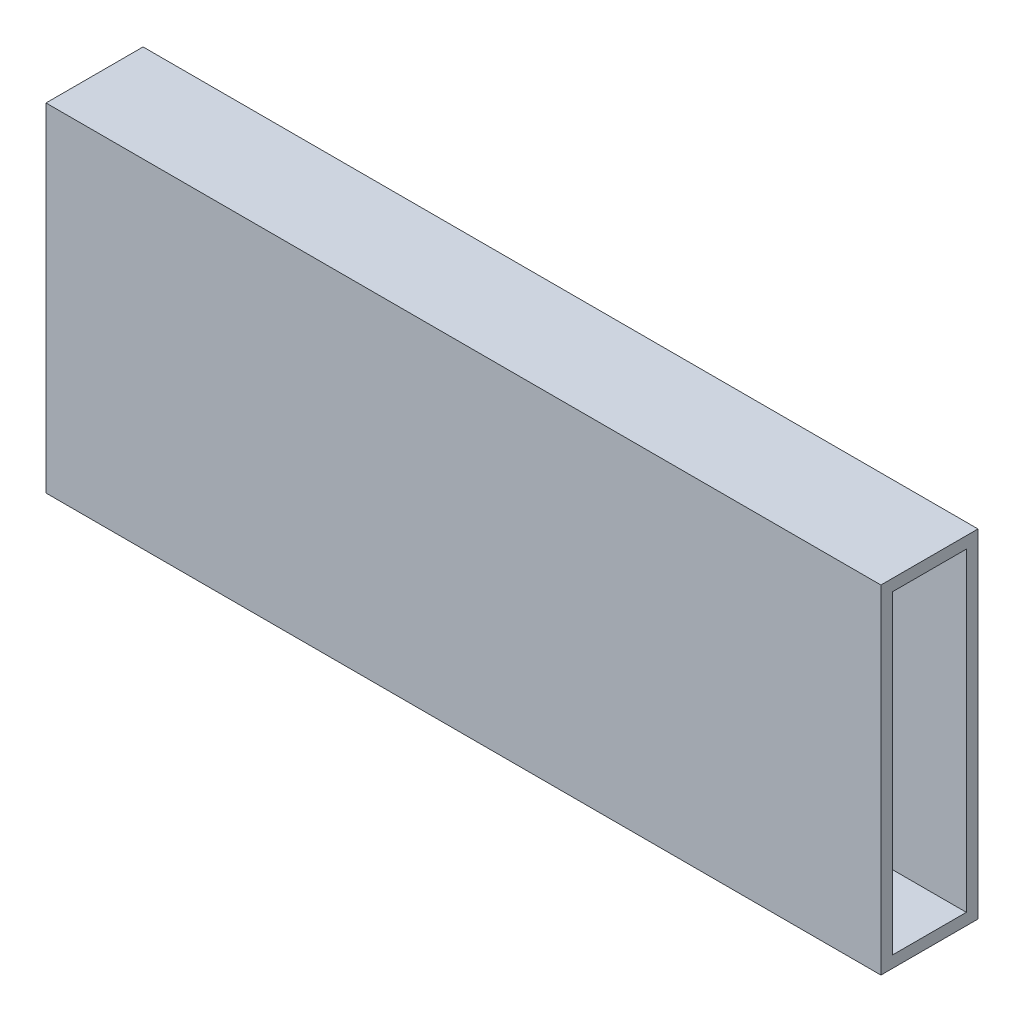
ISO-10303-21;
HEADER;
FILE_DESCRIPTION(('STEP AP214'),'2;1');
FILE_NAME('part.step','',(''),(''),'','','');
FILE_SCHEMA(('AUTOMOTIVE_DESIGN { 1 0 10303 214 1 1 1 1 }'));
ENDSEC;
DATA;
#1=APPLICATION_CONTEXT('core data for automotive mechanical design processes');
#2=APPLICATION_PROTOCOL_DEFINITION('international standard','automotive_design',2000,#1);
#3=PRODUCT_CONTEXT('',#1,'mechanical');
#4=PRODUCT('Part','Part','',(#3));
#5=PRODUCT_RELATED_PRODUCT_CATEGORY('part','',(#4));
#6=PRODUCT_DEFINITION_FORMATION('','',#4);
#7=PRODUCT_DEFINITION_CONTEXT('part definition',#1,'design');
#8=PRODUCT_DEFINITION('design','',#6,#7);
#9=PRODUCT_DEFINITION_SHAPE('','',#8);
#10=(LENGTH_UNIT() NAMED_UNIT(*) SI_UNIT(.MILLI.,.METRE.));
#11=(NAMED_UNIT(*) PLANE_ANGLE_UNIT() SI_UNIT($,.RADIAN.));
#12=(NAMED_UNIT(*) SI_UNIT($,.STERADIAN.) SOLID_ANGLE_UNIT());
#13=UNCERTAINTY_MEASURE_WITH_UNIT(LENGTH_MEASURE(1.E-05),#10,'distance_accuracy_value','');
#14=(GEOMETRIC_REPRESENTATION_CONTEXT(3) GLOBAL_UNCERTAINTY_ASSIGNED_CONTEXT((#13)) GLOBAL_UNIT_ASSIGNED_CONTEXT((#10,
#11,#12)) REPRESENTATION_CONTEXT('',''));
#15=CARTESIAN_POINT('',(0.,0.,0.));
#16=DIRECTION('',(0.,0.,1.));
#17=DIRECTION('',(1.,0.,0.));
#18=AXIS2_PLACEMENT_3D('',#15,#16,#17);
#19=CARTESIAN_POINT('',(107.5,87.,-12.5));
#20=DIRECTION('',(-1.,0.,0.));
#21=DIRECTION('',(0.,0.,1.));
#22=AXIS2_PLACEMENT_3D('',#19,#20,#21);
#23=PLANE('',#22);
#24=DIRECTION('',(0.,0.,-1.));
#25=VECTOR('',#24,1.);
#26=CARTESIAN_POINT('',(107.5,84.,-9.5));
#27=LINE('',#26,#25);
#28=CARTESIAN_POINT('',(107.5,84.,9.5));
#29=VERTEX_POINT('',#28);
#30=CARTESIAN_POINT('',(107.5,84.,-9.5));
#31=VERTEX_POINT('',#30);
#32=EDGE_CURVE('E117',#29,#31,#27,.T.);
#33=ORIENTED_EDGE('',*,*,#32,.T.);
#34=DIRECTION('',(0.,-1.,0.));
#35=VECTOR('',#34,1.);
#36=CARTESIAN_POINT('',(107.5,84.,-9.5));
#37=LINE('',#36,#35);
#38=CARTESIAN_POINT('',(107.5,3.,-9.5));
#39=VERTEX_POINT('',#38);
#40=EDGE_CURVE('E110',#31,#39,#37,.T.);
#41=ORIENTED_EDGE('',*,*,#40,.T.);
#42=DIRECTION('',(0.,0.,1.));
#43=VECTOR('',#42,1.);
#44=CARTESIAN_POINT('',(107.5,3.,-9.5));
#45=LINE('',#44,#43);
#46=CARTESIAN_POINT('',(107.5,3.,9.5));
#47=VERTEX_POINT('',#46);
#48=EDGE_CURVE('E120',#39,#47,#45,.T.);
#49=ORIENTED_EDGE('',*,*,#48,.T.);
#50=DIRECTION('',(0.,1.,0.));
#51=VECTOR('',#50,1.);
#52=CARTESIAN_POINT('',(107.5,84.,9.5));
#53=LINE('',#52,#51);
#54=EDGE_CURVE('E58',#47,#29,#53,.T.);
#55=ORIENTED_EDGE('',*,*,#54,.T.);
#56=EDGE_LOOP('',(#33,#41,#49,#55));
#57=FACE_BOUND('',#56,.T.);
#58=DIRECTION('',(0.,0.,-1.));
#59=VECTOR('',#58,1.);
#60=CARTESIAN_POINT('',(107.5,0.,-12.5));
#61=LINE('',#60,#59);
#62=CARTESIAN_POINT('',(107.5,0.,12.5));
#63=VERTEX_POINT('',#62);
#64=CARTESIAN_POINT('',(107.5,0.,-12.5));
#65=VERTEX_POINT('',#64);
#66=EDGE_CURVE('E154',#63,#65,#61,.T.);
#67=ORIENTED_EDGE('',*,*,#66,.T.);
#68=DIRECTION('',(0.,-1.,0.));
#69=VECTOR('',#68,1.);
#70=CARTESIAN_POINT('',(107.5,87.,-12.5));
#71=LINE('',#70,#69);
#72=CARTESIAN_POINT('',(107.5,87.,-12.5));
#73=VERTEX_POINT('',#72);
#74=EDGE_CURVE('E11',#73,#65,#71,.T.);
#75=ORIENTED_EDGE('',*,*,#74,.F.);
#76=DIRECTION('',(0.,0.,-1.));
#77=VECTOR('',#76,1.);
#78=CARTESIAN_POINT('',(107.5,87.,-12.5));
#79=LINE('',#78,#77);
#80=CARTESIAN_POINT('',(107.5,87.,12.5));
#81=VERTEX_POINT('',#80);
#82=EDGE_CURVE('E160',#81,#73,#79,.T.);
#83=ORIENTED_EDGE('',*,*,#82,.F.);
#84=DIRECTION('',(0.,-1.,0.));
#85=VECTOR('',#84,1.);
#86=CARTESIAN_POINT('',(107.5,87.,12.5));
#87=LINE('',#86,#85);
#88=EDGE_CURVE('E174',#81,#63,#87,.T.);
#89=ORIENTED_EDGE('',*,*,#88,.T.);
#90=EDGE_LOOP('',(#67,#75,#83,#89));
#91=FACE_BOUND('',#90,.T.);
#92=ADVANCED_FACE('F43',(#57,#91),#23,.F.);
#93=CARTESIAN_POINT('',(-107.5,87.,-12.5));
#94=DIRECTION('',(0.,0.,1.));
#95=DIRECTION('',(1.,0.,0.));
#96=AXIS2_PLACEMENT_3D('',#93,#94,#95);
#97=PLANE('',#96);
#98=DIRECTION('',(-1.,0.,0.));
#99=VECTOR('',#98,1.);
#100=CARTESIAN_POINT('',(-107.5,0.,-12.5));
#101=LINE('',#100,#99);
#102=CARTESIAN_POINT('',(-107.5,0.,-12.5));
#103=VERTEX_POINT('',#102);
#104=EDGE_CURVE('E178',#65,#103,#101,.T.);
#105=ORIENTED_EDGE('',*,*,#104,.T.);
#106=DIRECTION('',(0.,-1.,0.));
#107=VECTOR('',#106,1.);
#108=CARTESIAN_POINT('',(-107.5,87.,-12.5));
#109=LINE('',#108,#107);
#110=CARTESIAN_POINT('',(-107.5,87.,-12.5));
#111=VERTEX_POINT('',#110);
#112=EDGE_CURVE('E51',#111,#103,#109,.T.);
#113=ORIENTED_EDGE('',*,*,#112,.F.);
#114=DIRECTION('',(-1.,0.,0.));
#115=VECTOR('',#114,1.);
#116=CARTESIAN_POINT('',(-107.5,87.,-12.5));
#117=LINE('',#116,#115);
#118=EDGE_CURVE('E164',#73,#111,#117,.T.);
#119=ORIENTED_EDGE('',*,*,#118,.F.);
#120=ORIENTED_EDGE('',*,*,#74,.T.);
#121=EDGE_LOOP('',(#105,#113,#119,#120));
#122=FACE_BOUND('',#121,.T.);
#123=ADVANCED_FACE('F213',(#122),#97,.F.);
#124=CARTESIAN_POINT('',(-107.5,87.,-12.5));
#125=DIRECTION('',(1.,0.,0.));
#126=DIRECTION('',(0.,0.,-1.));
#127=AXIS2_PLACEMENT_3D('',#124,#125,#126);
#128=PLANE('',#127);
#129=DIRECTION('',(0.,0.,1.));
#130=VECTOR('',#129,1.);
#131=CARTESIAN_POINT('',(-107.5,3.,-9.5));
#132=LINE('',#131,#130);
#133=CARTESIAN_POINT('',(-107.5,3.,-9.5));
#134=VERTEX_POINT('',#133);
#135=CARTESIAN_POINT('',(-107.5,3.,9.50000000000001));
#136=VERTEX_POINT('',#135);
#137=EDGE_CURVE('E144',#134,#136,#132,.T.);
#138=ORIENTED_EDGE('',*,*,#137,.F.);
#139=DIRECTION('',(0.,-1.,0.));
#140=VECTOR('',#139,1.);
#141=CARTESIAN_POINT('',(-107.5,84.,-9.5));
#142=LINE('',#141,#140);
#143=CARTESIAN_POINT('',(-107.5,84.,-9.5));
#144=VERTEX_POINT('',#143);
#145=EDGE_CURVE('E66',#144,#134,#142,.T.);
#146=ORIENTED_EDGE('',*,*,#145,.F.);
#147=DIRECTION('',(0.,0.,-1.));
#148=VECTOR('',#147,1.);
#149=CARTESIAN_POINT('',(-107.5,84.,-9.5));
#150=LINE('',#149,#148);
#151=CARTESIAN_POINT('',(-107.5,84.,9.5));
#152=VERTEX_POINT('',#151);
#153=EDGE_CURVE('E128',#152,#144,#150,.T.);
#154=ORIENTED_EDGE('',*,*,#153,.F.);
#155=DIRECTION('',(0.,1.,0.));
#156=VECTOR('',#155,1.);
#157=CARTESIAN_POINT('',(-107.5,84.,9.5));
#158=LINE('',#157,#156);
#159=EDGE_CURVE('E132',#136,#152,#158,.T.);
#160=ORIENTED_EDGE('',*,*,#159,.F.);
#161=EDGE_LOOP('',(#138,#146,#154,#160));
#162=FACE_BOUND('',#161,.T.);
#163=DIRECTION('',(0.,0.,1.));
#164=VECTOR('',#163,1.);
#165=CARTESIAN_POINT('',(-107.5,0.,-12.5));
#166=LINE('',#165,#164);
#167=CARTESIAN_POINT('',(-107.5,0.,12.5));
#168=VERTEX_POINT('',#167);
#169=EDGE_CURVE('E181',#103,#168,#166,.T.);
#170=ORIENTED_EDGE('',*,*,#169,.T.);
#171=DIRECTION('',(0.,-1.,0.));
#172=VECTOR('',#171,1.);
#173=CARTESIAN_POINT('',(-107.5,87.,12.5));
#174=LINE('',#173,#172);
#175=CARTESIAN_POINT('',(-107.5,87.,12.5));
#176=VERTEX_POINT('',#175);
#177=EDGE_CURVE('E189',#176,#168,#174,.T.);
#178=ORIENTED_EDGE('',*,*,#177,.F.);
#179=DIRECTION('',(0.,0.,1.));
#180=VECTOR('',#179,1.);
#181=CARTESIAN_POINT('',(-107.5,87.,-12.5));
#182=LINE('',#181,#180);
#183=EDGE_CURVE('E168',#111,#176,#182,.T.);
#184=ORIENTED_EDGE('',*,*,#183,.F.);
#185=ORIENTED_EDGE('',*,*,#112,.T.);
#186=EDGE_LOOP('',(#170,#178,#184,#185));
#187=FACE_BOUND('',#186,.T.);
#188=ADVANCED_FACE('F198',(#162,#187),#128,.F.);
#189=CARTESIAN_POINT('',(-107.5,87.,12.5));
#190=DIRECTION('',(0.,0.,-1.));
#191=DIRECTION('',(-1.,0.,0.));
#192=AXIS2_PLACEMENT_3D('',#189,#190,#191);
#193=PLANE('',#192);
#194=DIRECTION('',(1.,0.,0.));
#195=VECTOR('',#194,1.);
#196=CARTESIAN_POINT('',(-107.5,0.,12.5));
#197=LINE('',#196,#195);
#198=EDGE_CURVE('E165',#168,#63,#197,.T.);
#199=ORIENTED_EDGE('',*,*,#198,.T.);
#200=ORIENTED_EDGE('',*,*,#88,.F.);
#201=DIRECTION('',(1.,0.,0.));
#202=VECTOR('',#201,1.);
#203=CARTESIAN_POINT('',(-107.5,87.,12.5));
#204=LINE('',#203,#202);
#205=EDGE_CURVE('E171',#176,#81,#204,.T.);
#206=ORIENTED_EDGE('',*,*,#205,.F.);
#207=ORIENTED_EDGE('',*,*,#177,.T.);
#208=EDGE_LOOP('',(#199,#200,#206,#207));
#209=FACE_BOUND('',#208,.T.);
#210=ADVANCED_FACE('F207',(#209),#193,.F.);
#211=CARTESIAN_POINT('',(0.,87.,0.));
#212=DIRECTION('',(0.,1.,0.));
#213=DIRECTION('',(0.,0.,1.));
#214=AXIS2_PLACEMENT_3D('',#211,#212,#213);
#215=PLANE('',#214);
#216=ORIENTED_EDGE('',*,*,#82,.T.);
#217=ORIENTED_EDGE('',*,*,#118,.T.);
#218=ORIENTED_EDGE('',*,*,#183,.T.);
#219=ORIENTED_EDGE('',*,*,#205,.T.);
#220=EDGE_LOOP('',(#216,#217,#218,#219));
#221=FACE_BOUND('',#220,.T.);
#222=ADVANCED_FACE('F212',(#221),#215,.T.);
#223=CARTESIAN_POINT('',(0.,0.,0.));
#224=DIRECTION('',(0.,1.,0.));
#225=DIRECTION('',(0.,0.,1.));
#226=AXIS2_PLACEMENT_3D('',#223,#224,#225);
#227=PLANE('',#226);
#228=CARTESIAN_POINT('',(-50.,0.,0.));
#229=DIRECTION('',(0.,-1.,0.));
#230=DIRECTION('',(0.,0.,-1.));
#231=AXIS2_PLACEMENT_3D('',#228,#229,#230);
#232=CIRCLE('',#231,1.5);
#233=CARTESIAN_POINT('',(-50.,0.,-1.5));
#234=VERTEX_POINT('',#233);
#235=EDGE_CURVE('E255',#234,#234,#232,.T.);
#236=ORIENTED_EDGE('',*,*,#235,.F.);
#237=EDGE_LOOP('',(#236));
#238=FACE_BOUND('',#237,.T.);
#239=CARTESIAN_POINT('',(50.,0.,0.));
#240=DIRECTION('',(0.,-1.,0.));
#241=DIRECTION('',(0.,0.,-1.));
#242=AXIS2_PLACEMENT_3D('',#239,#240,#241);
#243=CIRCLE('',#242,1.5);
#244=CARTESIAN_POINT('',(50.,0.,-1.5));
#245=VERTEX_POINT('',#244);
#246=EDGE_CURVE('E257',#245,#245,#243,.T.);
#247=ORIENTED_EDGE('',*,*,#246,.F.);
#248=EDGE_LOOP('',(#247));
#249=FACE_BOUND('',#248,.T.);
#250=ORIENTED_EDGE('',*,*,#66,.F.);
#251=ORIENTED_EDGE('',*,*,#198,.F.);
#252=ORIENTED_EDGE('',*,*,#169,.F.);
#253=ORIENTED_EDGE('',*,*,#104,.F.);
#254=EDGE_LOOP('',(#250,#251,#252,#253));
#255=FACE_BOUND('',#254,.T.);
#256=ADVANCED_FACE('F204',(#238,#249,#255),#227,.F.);
#257=CARTESIAN_POINT('',(107.5,84.,-9.5));
#258=DIRECTION('',(0.,0.,-1.));
#259=DIRECTION('',(0.,1.,0.));
#260=AXIS2_PLACEMENT_3D('',#257,#258,#259);
#261=PLANE('',#260);
#262=ORIENTED_EDGE('',*,*,#145,.T.);
#263=DIRECTION('',(-1.,0.,0.));
#264=VECTOR('',#263,1.);
#265=CARTESIAN_POINT('',(107.5,3.,-9.5));
#266=LINE('',#265,#264);
#267=EDGE_CURVE('E106',#39,#134,#266,.T.);
#268=ORIENTED_EDGE('',*,*,#267,.F.);
#269=ORIENTED_EDGE('',*,*,#40,.F.);
#270=DIRECTION('',(-1.,0.,0.));
#271=VECTOR('',#270,1.);
#272=CARTESIAN_POINT('',(107.5,84.,-9.5));
#273=LINE('',#272,#271);
#274=EDGE_CURVE('E151',#31,#144,#273,.T.);
#275=ORIENTED_EDGE('',*,*,#274,.T.);
#276=EDGE_LOOP('',(#262,#268,#269,#275));
#277=FACE_BOUND('',#276,.T.);
#278=ADVANCED_FACE('F108',(#277),#261,.F.);
#279=CARTESIAN_POINT('',(107.5,84.,-9.5));
#280=DIRECTION('',(0.,1.,0.));
#281=DIRECTION('',(0.,0.,1.));
#282=AXIS2_PLACEMENT_3D('',#279,#280,#281);
#283=PLANE('',#282);
#284=ORIENTED_EDGE('',*,*,#153,.T.);
#285=ORIENTED_EDGE('',*,*,#274,.F.);
#286=ORIENTED_EDGE('',*,*,#32,.F.);
#287=DIRECTION('',(-1.,0.,0.));
#288=VECTOR('',#287,1.);
#289=CARTESIAN_POINT('',(107.5,84.,9.5));
#290=LINE('',#289,#288);
#291=EDGE_CURVE('E155',#29,#152,#290,.T.);
#292=ORIENTED_EDGE('',*,*,#291,.T.);
#293=EDGE_LOOP('',(#284,#285,#286,#292));
#294=FACE_BOUND('',#293,.T.);
#295=ADVANCED_FACE('F231',(#294),#283,.F.);
#296=CARTESIAN_POINT('',(107.5,84.,9.5));
#297=DIRECTION('',(0.,0.,1.));
#298=DIRECTION('',(0.,-1.,0.));
#299=AXIS2_PLACEMENT_3D('',#296,#297,#298);
#300=PLANE('',#299);
#301=ORIENTED_EDGE('',*,*,#159,.T.);
#302=ORIENTED_EDGE('',*,*,#291,.F.);
#303=ORIENTED_EDGE('',*,*,#54,.F.);
#304=DIRECTION('',(-1.,0.,0.));
#305=VECTOR('',#304,1.);
#306=CARTESIAN_POINT('',(107.5,3.,9.50000000000001));
#307=LINE('',#306,#305);
#308=EDGE_CURVE('E116',#47,#136,#307,.T.);
#309=ORIENTED_EDGE('',*,*,#308,.T.);
#310=EDGE_LOOP('',(#301,#302,#303,#309));
#311=FACE_BOUND('',#310,.T.);
#312=ADVANCED_FACE('F235',(#311),#300,.F.);
#313=CARTESIAN_POINT('',(107.5,3.,-9.5));
#314=DIRECTION('',(0.,-1.,0.));
#315=DIRECTION('',(0.,0.,-1.));
#316=AXIS2_PLACEMENT_3D('',#313,#314,#315);
#317=PLANE('',#316);
#318=CARTESIAN_POINT('',(-50.,3.,0.));
#319=DIRECTION('',(0.,-1.,0.));
#320=DIRECTION('',(0.,0.,-1.));
#321=AXIS2_PLACEMENT_3D('',#318,#319,#320);
#322=CIRCLE('',#321,1.5);
#323=CARTESIAN_POINT('',(-50.,3.,-1.5));
#324=VERTEX_POINT('',#323);
#325=EDGE_CURVE('E145',#324,#324,#322,.T.);
#326=ORIENTED_EDGE('',*,*,#325,.T.);
#327=EDGE_LOOP('',(#326));
#328=FACE_BOUND('',#327,.T.);
#329=CARTESIAN_POINT('',(50.,3.,0.));
#330=DIRECTION('',(0.,-1.,0.));
#331=DIRECTION('',(0.,0.,-1.));
#332=AXIS2_PLACEMENT_3D('',#329,#330,#331);
#333=CIRCLE('',#332,1.5);
#334=CARTESIAN_POINT('',(50.,3.,-1.5));
#335=VERTEX_POINT('',#334);
#336=EDGE_CURVE('E135',#335,#335,#333,.T.);
#337=ORIENTED_EDGE('',*,*,#336,.T.);
#338=EDGE_LOOP('',(#337));
#339=FACE_BOUND('',#338,.T.);
#340=ORIENTED_EDGE('',*,*,#137,.T.);
#341=ORIENTED_EDGE('',*,*,#308,.F.);
#342=ORIENTED_EDGE('',*,*,#48,.F.);
#343=ORIENTED_EDGE('',*,*,#267,.T.);
#344=EDGE_LOOP('',(#340,#341,#342,#343));
#345=FACE_BOUND('',#344,.T.);
#346=ADVANCED_FACE('F121',(#328,#339,#345),#317,.F.);
#347=CARTESIAN_POINT('',(50.,3.,0.));
#348=DIRECTION('',(0.,-1.,0.));
#349=DIRECTION('',(0.,0.,-1.));
#350=AXIS2_PLACEMENT_3D('',#347,#348,#349);
#351=CYLINDRICAL_SURFACE('',#350,1.5);
#352=ORIENTED_EDGE('',*,*,#336,.F.);
#353=EDGE_LOOP('',(#352));
#354=FACE_BOUND('',#353,.T.);
#355=ORIENTED_EDGE('',*,*,#246,.T.);
#356=EDGE_LOOP('',(#355));
#357=FACE_BOUND('',#356,.T.);
#358=ADVANCED_FACE('F234',(#354,#357),#351,.F.);
#359=CARTESIAN_POINT('',(-50.,3.,0.));
#360=DIRECTION('',(0.,-1.,0.));
#361=DIRECTION('',(0.,0.,-1.));
#362=AXIS2_PLACEMENT_3D('',#359,#360,#361);
#363=CYLINDRICAL_SURFACE('',#362,1.5);
#364=ORIENTED_EDGE('',*,*,#325,.F.);
#365=EDGE_LOOP('',(#364));
#366=FACE_BOUND('',#365,.T.);
#367=ORIENTED_EDGE('',*,*,#235,.T.);
#368=EDGE_LOOP('',(#367));
#369=FACE_BOUND('',#368,.T.);
#370=ADVANCED_FACE('F244',(#366,#369),#363,.F.);
#371=CLOSED_SHELL('',(#92,#123,#188,#210,#222,#256,#278,#295,#312,#346,#358,#370));
#372=MANIFOLD_SOLID_BREP('B2',#371);
#373=ADVANCED_BREP_SHAPE_REPRESENTATION('',(#18,#372),#14);
#374=SHAPE_DEFINITION_REPRESENTATION(#9,#373);
ENDSEC;
END-ISO-10303-21;
